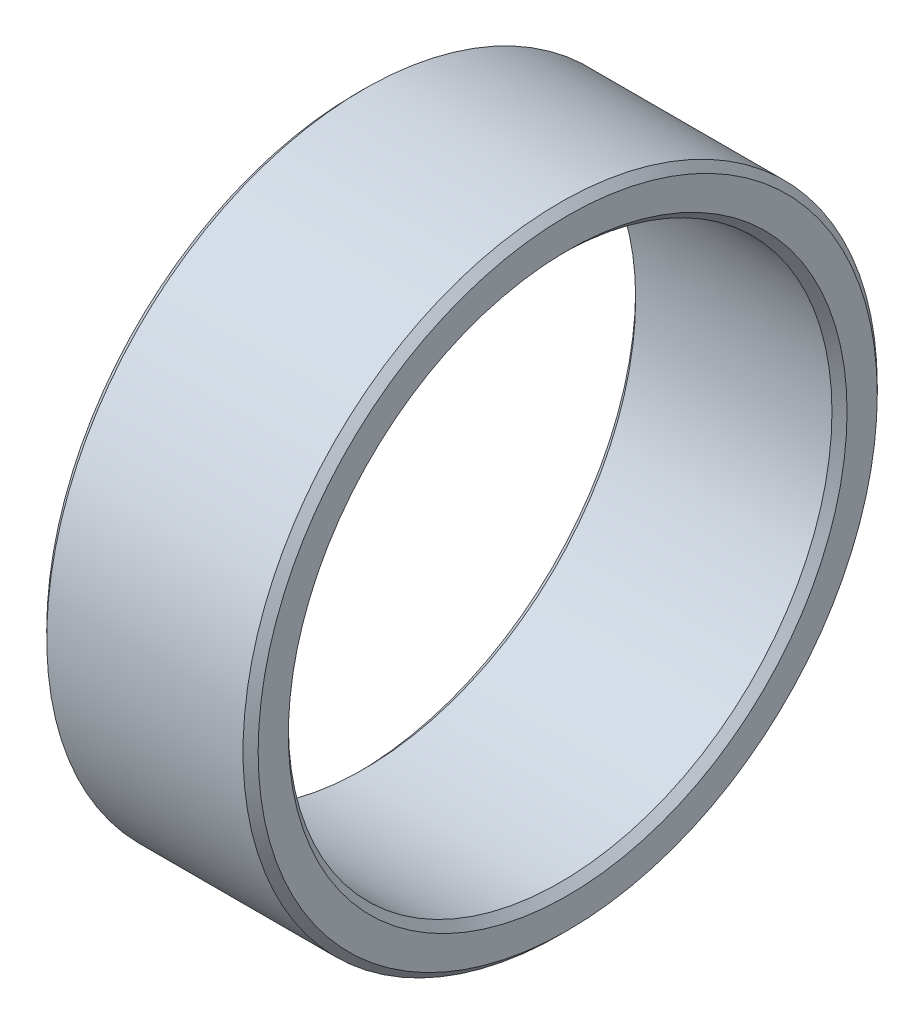
ISO-10303-21;
HEADER;
FILE_DESCRIPTION(('STEP AP214'),'2;1');
FILE_NAME('part.step','',(''),(''),'','','');
FILE_SCHEMA(('AUTOMOTIVE_DESIGN { 1 0 10303 214 1 1 1 1 }'));
ENDSEC;
DATA;
#1=APPLICATION_CONTEXT('core data for automotive mechanical design processes');
#2=APPLICATION_PROTOCOL_DEFINITION('international standard','automotive_design',2000,#1);
#3=PRODUCT_CONTEXT('',#1,'mechanical');
#4=PRODUCT('Part','Part','',(#3));
#5=PRODUCT_RELATED_PRODUCT_CATEGORY('part','',(#4));
#6=PRODUCT_DEFINITION_FORMATION('','',#4);
#7=PRODUCT_DEFINITION_CONTEXT('part definition',#1,'design');
#8=PRODUCT_DEFINITION('design','',#6,#7);
#9=PRODUCT_DEFINITION_SHAPE('','',#8);
#10=(LENGTH_UNIT() NAMED_UNIT(*) SI_UNIT(.MILLI.,.METRE.));
#11=(NAMED_UNIT(*) PLANE_ANGLE_UNIT() SI_UNIT($,.RADIAN.));
#12=(NAMED_UNIT(*) SI_UNIT($,.STERADIAN.) SOLID_ANGLE_UNIT());
#13=UNCERTAINTY_MEASURE_WITH_UNIT(LENGTH_MEASURE(1.E-05),#10,'distance_accuracy_value','');
#14=(GEOMETRIC_REPRESENTATION_CONTEXT(3) GLOBAL_UNCERTAINTY_ASSIGNED_CONTEXT((#13)) GLOBAL_UNIT_ASSIGNED_CONTEXT((#10,
#11,#12)) REPRESENTATION_CONTEXT('',''));
#15=CARTESIAN_POINT('',(0.,0.,0.));
#16=DIRECTION('',(0.,0.,1.));
#17=DIRECTION('',(1.,0.,0.));
#18=AXIS2_PLACEMENT_3D('',#15,#16,#17);
#19=CARTESIAN_POINT('',(14.,0.,0.));
#20=DIRECTION('',(1.,0.,0.));
#21=DIRECTION('',(0.,0.,-1.));
#22=AXIS2_PLACEMENT_3D('',#19,#20,#21);
#23=PLANE('',#22);
#24=CARTESIAN_POINT('',(14.,0.,0.));
#25=DIRECTION('',(1.,0.,0.));
#26=DIRECTION('',(0.,0.,-1.));
#27=AXIS2_PLACEMENT_3D('',#24,#25,#26);
#28=CIRCLE('',#27,18.5);
#29=CARTESIAN_POINT('',(14.,0.,-18.5));
#30=VERTEX_POINT('',#29);
#31=EDGE_CURVE('E10',#30,#30,#28,.F.);
#32=ORIENTED_EDGE('',*,*,#31,.T.);
#33=EDGE_LOOP('',(#32));
#34=FACE_BOUND('',#33,.T.);
#35=CARTESIAN_POINT('',(14.,0.,0.));
#36=DIRECTION('',(1.,0.,0.));
#37=DIRECTION('',(0.,0.,-1.));
#38=AXIS2_PLACEMENT_3D('',#35,#36,#37);
#39=CIRCLE('',#38,20.5);
#40=CARTESIAN_POINT('',(14.,0.,-20.5));
#41=VERTEX_POINT('',#40);
#42=EDGE_CURVE('E39',#41,#41,#39,.T.);
#43=ORIENTED_EDGE('',*,*,#42,.T.);
#44=EDGE_LOOP('',(#43));
#45=FACE_BOUND('',#44,.T.);
#46=ADVANCED_FACE('F32',(#34,#45),#23,.T.);
#47=CARTESIAN_POINT('',(0.,0.,0.));
#48=DIRECTION('',(1.,0.,0.));
#49=DIRECTION('',(0.,0.,-1.));
#50=AXIS2_PLACEMENT_3D('',#47,#48,#49);
#51=PLANE('',#50);
#52=CARTESIAN_POINT('',(0.,0.,0.));
#53=DIRECTION('',(1.,0.,0.));
#54=DIRECTION('',(0.,0.,-1.));
#55=AXIS2_PLACEMENT_3D('',#52,#53,#54);
#56=CIRCLE('',#55,20.5);
#57=CARTESIAN_POINT('',(0.,0.,-20.5));
#58=VERTEX_POINT('',#57);
#59=EDGE_CURVE('E52',#58,#58,#56,.F.);
#60=ORIENTED_EDGE('',*,*,#59,.T.);
#61=EDGE_LOOP('',(#60));
#62=FACE_BOUND('',#61,.T.);
#63=CARTESIAN_POINT('',(0.,0.,0.));
#64=DIRECTION('',(1.,0.,0.));
#65=DIRECTION('',(0.,0.,-1.));
#66=AXIS2_PLACEMENT_3D('',#63,#64,#65);
#67=CIRCLE('',#66,18.5);
#68=CARTESIAN_POINT('',(0.,0.,-18.5));
#69=VERTEX_POINT('',#68);
#70=EDGE_CURVE('E55',#69,#69,#67,.T.);
#71=ORIENTED_EDGE('',*,*,#70,.T.);
#72=EDGE_LOOP('',(#71));
#73=FACE_BOUND('',#72,.T.);
#74=ADVANCED_FACE('F76',(#62,#73),#51,.F.);
#75=CARTESIAN_POINT('',(14.,0.,0.));
#76=DIRECTION('',(-1.,0.,0.));
#77=DIRECTION('',(0.,0.,1.));
#78=AXIS2_PLACEMENT_3D('',#75,#76,#77);
#79=CYLINDRICAL_SURFACE('',#78,21.);
#80=CARTESIAN_POINT('',(0.499999999999997,0.,0.));
#81=DIRECTION('',(1.,0.,0.));
#82=DIRECTION('',(0.,0.,-1.));
#83=AXIS2_PLACEMENT_3D('',#80,#81,#82);
#84=CIRCLE('',#83,21.);
#85=CARTESIAN_POINT('',(0.499999999999997,0.,-21.));
#86=VERTEX_POINT('',#85);
#87=EDGE_CURVE('E58',#86,#86,#84,.T.);
#88=ORIENTED_EDGE('',*,*,#87,.T.);
#89=EDGE_LOOP('',(#88));
#90=FACE_BOUND('',#89,.T.);
#91=CARTESIAN_POINT('',(13.5,0.,0.));
#92=DIRECTION('',(1.,0.,0.));
#93=DIRECTION('',(0.,0.,-1.));
#94=AXIS2_PLACEMENT_3D('',#91,#92,#93);
#95=CIRCLE('',#94,21.);
#96=CARTESIAN_POINT('',(13.5,0.,-21.));
#97=VERTEX_POINT('',#96);
#98=EDGE_CURVE('E61',#97,#97,#95,.F.);
#99=ORIENTED_EDGE('',*,*,#98,.T.);
#100=EDGE_LOOP('',(#99));
#101=FACE_BOUND('',#100,.T.);
#102=ADVANCED_FACE('F65',(#90,#101),#79,.T.);
#103=CARTESIAN_POINT('',(14.,0.,0.));
#104=DIRECTION('',(-1.,0.,0.));
#105=DIRECTION('',(0.,0.,1.));
#106=AXIS2_PLACEMENT_3D('',#103,#104,#105);
#107=CYLINDRICAL_SURFACE('',#106,18.);
#108=CARTESIAN_POINT('',(0.500000000000007,0.,0.));
#109=DIRECTION('',(1.,0.,0.));
#110=DIRECTION('',(0.,0.,-1.));
#111=AXIS2_PLACEMENT_3D('',#108,#109,#110);
#112=CIRCLE('',#111,18.);
#113=CARTESIAN_POINT('',(0.500000000000007,0.,-18.));
#114=VERTEX_POINT('',#113);
#115=EDGE_CURVE('E43',#114,#114,#112,.F.);
#116=ORIENTED_EDGE('',*,*,#115,.T.);
#117=EDGE_LOOP('',(#116));
#118=FACE_BOUND('',#117,.T.);
#119=CARTESIAN_POINT('',(13.5,0.,0.));
#120=DIRECTION('',(1.,0.,0.));
#121=DIRECTION('',(0.,0.,-1.));
#122=AXIS2_PLACEMENT_3D('',#119,#120,#121);
#123=CIRCLE('',#122,18.);
#124=CARTESIAN_POINT('',(13.5,0.,-18.));
#125=VERTEX_POINT('',#124);
#126=EDGE_CURVE('E47',#125,#125,#123,.T.);
#127=ORIENTED_EDGE('',*,*,#126,.T.);
#128=EDGE_LOOP('',(#127));
#129=FACE_BOUND('',#128,.T.);
#130=ADVANCED_FACE('F84',(#118,#129),#107,.F.);
#131=CARTESIAN_POINT('',(0.499999999999997,0.,0.));
#132=DIRECTION('',(1.,0.,0.));
#133=DIRECTION('',(0.,0.,-1.));
#134=AXIS2_PLACEMENT_3D('',#131,#132,#133);
#135=CONICAL_SURFACE('',#134,21.,0.785398163397455);
#136=ORIENTED_EDGE('',*,*,#59,.F.);
#137=EDGE_LOOP('',(#136));
#138=FACE_BOUND('',#137,.T.);
#139=ORIENTED_EDGE('',*,*,#87,.F.);
#140=EDGE_LOOP('',(#139));
#141=FACE_BOUND('',#140,.T.);
#142=ADVANCED_FACE('F89',(#138,#141),#135,.T.);
#143=CARTESIAN_POINT('',(0.,0.,0.));
#144=DIRECTION('',(-1.,0.,0.));
#145=DIRECTION('',(0.,0.,1.));
#146=AXIS2_PLACEMENT_3D('',#143,#144,#145);
#147=CONICAL_SURFACE('',#146,18.5,0.785398163397445);
#148=ORIENTED_EDGE('',*,*,#115,.F.);
#149=EDGE_LOOP('',(#148));
#150=FACE_BOUND('',#149,.T.);
#151=ORIENTED_EDGE('',*,*,#70,.F.);
#152=EDGE_LOOP('',(#151));
#153=FACE_BOUND('',#152,.T.);
#154=ADVANCED_FACE('F73',(#150,#153),#147,.F.);
#155=CARTESIAN_POINT('',(13.5,0.,0.));
#156=DIRECTION('',(1.,0.,0.));
#157=DIRECTION('',(0.,0.,-1.));
#158=AXIS2_PLACEMENT_3D('',#155,#156,#157);
#159=CONICAL_SURFACE('',#158,18.,0.785398163397448);
#160=ORIENTED_EDGE('',*,*,#31,.F.);
#161=EDGE_LOOP('',(#160));
#162=FACE_BOUND('',#161,.T.);
#163=ORIENTED_EDGE('',*,*,#126,.F.);
#164=EDGE_LOOP('',(#163));
#165=FACE_BOUND('',#164,.T.);
#166=ADVANCED_FACE('F69',(#162,#165),#159,.F.);
#167=CARTESIAN_POINT('',(14.,0.,0.));
#168=DIRECTION('',(-1.,0.,0.));
#169=DIRECTION('',(0.,0.,1.));
#170=AXIS2_PLACEMENT_3D('',#167,#168,#169);
#171=CONICAL_SURFACE('',#170,20.5,0.785398163397445);
#172=ORIENTED_EDGE('',*,*,#98,.F.);
#173=EDGE_LOOP('',(#172));
#174=FACE_BOUND('',#173,.T.);
#175=ORIENTED_EDGE('',*,*,#42,.F.);
#176=EDGE_LOOP('',(#175));
#177=FACE_BOUND('',#176,.T.);
#178=ADVANCED_FACE('F34',(#174,#177),#171,.T.);
#179=CLOSED_SHELL('',(#46,#74,#102,#130,#142,#154,#166,#178));
#180=MANIFOLD_SOLID_BREP('B2',#179);
#181=ADVANCED_BREP_SHAPE_REPRESENTATION('',(#18,#180),#14);
#182=SHAPE_DEFINITION_REPRESENTATION(#9,#181);
ENDSEC;
END-ISO-10303-21;
